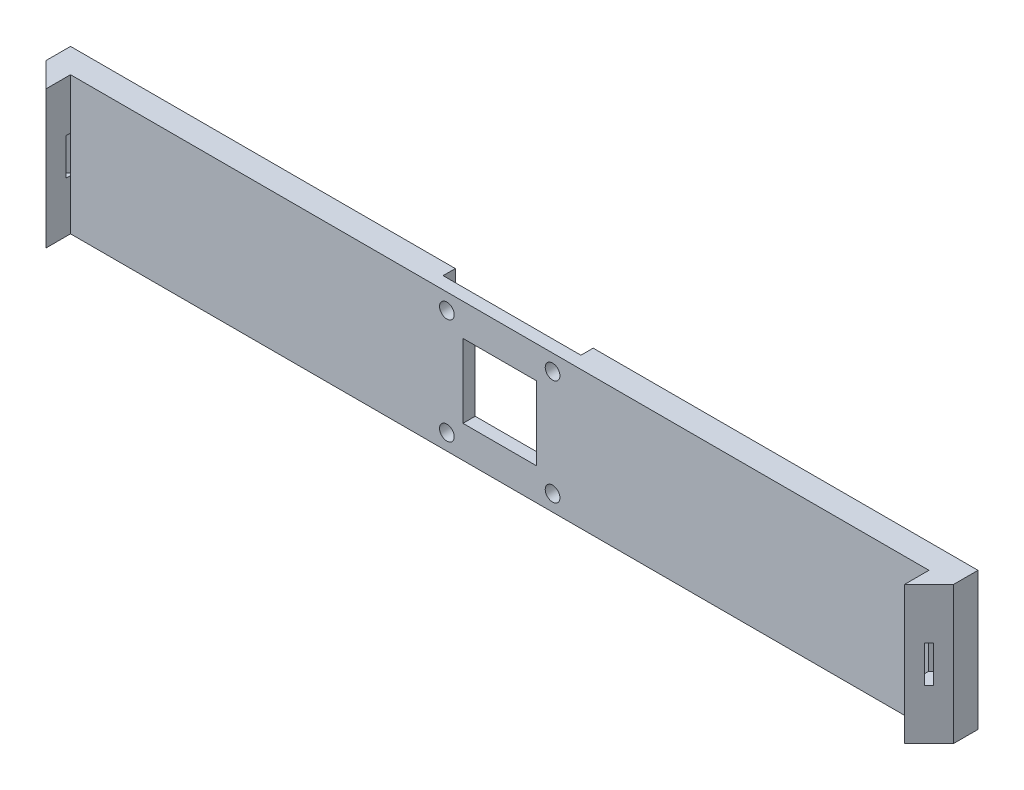
ISO-10303-21;
HEADER;
FILE_DESCRIPTION(('STEP AP214'),'2;1');
FILE_NAME('part.step','',(''),(''),'','','');
FILE_SCHEMA(('AUTOMOTIVE_DESIGN { 1 0 10303 214 1 1 1 1 }'));
ENDSEC;
DATA;
#1=APPLICATION_CONTEXT('core data for automotive mechanical design processes');
#2=APPLICATION_PROTOCOL_DEFINITION('international standard','automotive_design',2000,#1);
#3=PRODUCT_CONTEXT('',#1,'mechanical');
#4=PRODUCT('Part','Part','',(#3));
#5=PRODUCT_RELATED_PRODUCT_CATEGORY('part','',(#4));
#6=PRODUCT_DEFINITION_FORMATION('','',#4);
#7=PRODUCT_DEFINITION_CONTEXT('part definition',#1,'design');
#8=PRODUCT_DEFINITION('design','',#6,#7);
#9=PRODUCT_DEFINITION_SHAPE('','',#8);
#10=(LENGTH_UNIT() NAMED_UNIT(*) SI_UNIT(.MILLI.,.METRE.));
#11=(NAMED_UNIT(*) PLANE_ANGLE_UNIT() SI_UNIT($,.RADIAN.));
#12=(NAMED_UNIT(*) SI_UNIT($,.STERADIAN.) SOLID_ANGLE_UNIT());
#13=UNCERTAINTY_MEASURE_WITH_UNIT(LENGTH_MEASURE(1.E-05),#10,'distance_accuracy_value','');
#14=(GEOMETRIC_REPRESENTATION_CONTEXT(3) GLOBAL_UNCERTAINTY_ASSIGNED_CONTEXT((#13)) GLOBAL_UNIT_ASSIGNED_CONTEXT((#10,
#11,#12)) REPRESENTATION_CONTEXT('',''));
#15=CARTESIAN_POINT('',(0.,0.,0.));
#16=DIRECTION('',(0.,0.,1.));
#17=DIRECTION('',(1.,0.,0.));
#18=AXIS2_PLACEMENT_3D('',#15,#16,#17);
#19=CARTESIAN_POINT('',(0.,0.,0.));
#20=DIRECTION('',(0.,0.,-1.));
#21=DIRECTION('',(-1.,0.,0.));
#22=AXIS2_PLACEMENT_3D('',#19,#20,#21);
#23=PLANE('',#22);
#24=DIRECTION('',(0.,1.,0.));
#25=VECTOR('',#24,1.);
#26=CARTESIAN_POINT('',(-28.0999999999999,-28.1,0.));
#27=LINE('',#26,#25);
#28=CARTESIAN_POINT('',(-28.0999999999999,-28.1,0.));
#29=VERTEX_POINT('',#28);
#30=CARTESIAN_POINT('',(-28.0999999999999,28.1,0.));
#31=VERTEX_POINT('',#30);
#32=EDGE_CURVE('E214',#29,#31,#27,.T.);
#33=ORIENTED_EDGE('',*,*,#32,.F.);
#34=DIRECTION('',(1.,0.,0.));
#35=VECTOR('',#34,1.);
#36=CARTESIAN_POINT('',(-175.,-28.1,0.));
#37=LINE('',#36,#35);
#38=CARTESIAN_POINT('',(-185.,-28.1,0.));
#39=VERTEX_POINT('',#38);
#40=EDGE_CURVE('E424',#39,#29,#37,.T.);
#41=ORIENTED_EDGE('',*,*,#40,.F.);
#42=DIRECTION('',(0.,-1.,0.));
#43=VECTOR('',#42,1.);
#44=CARTESIAN_POINT('',(-185.,-28.1,0.));
#45=LINE('',#44,#43);
#46=CARTESIAN_POINT('',(-185.,28.1,0.));
#47=VERTEX_POINT('',#46);
#48=EDGE_CURVE('E384',#47,#39,#45,.T.);
#49=ORIENTED_EDGE('',*,*,#48,.F.);
#50=DIRECTION('',(-1.,0.,0.));
#51=VECTOR('',#50,1.);
#52=CARTESIAN_POINT('',(-175.,28.1,0.));
#53=LINE('',#52,#51);
#54=EDGE_CURVE('E419',#31,#47,#53,.T.);
#55=ORIENTED_EDGE('',*,*,#54,.F.);
#56=EDGE_LOOP('',(#33,#41,#49,#55));
#57=FACE_BOUND('',#56,.T.);
#58=ADVANCED_FACE('F36',(#57),#23,.T.);
#59=CARTESIAN_POINT('',(0.,0.,10.));
#60=DIRECTION('',(0.,0.,-1.));
#61=DIRECTION('',(-1.,0.,0.));
#62=AXIS2_PLACEMENT_3D('',#59,#60,#61);
#63=PLANE('',#62);
#64=DIRECTION('',(0.,-1.,0.));
#65=VECTOR('',#64,1.);
#66=CARTESIAN_POINT('',(175.,28.1,10.));
#67=LINE('',#66,#65);
#68=CARTESIAN_POINT('',(175.,28.1,10.));
#69=VERTEX_POINT('',#68);
#70=CARTESIAN_POINT('',(175.,-28.1,10.));
#71=VERTEX_POINT('',#70);
#72=EDGE_CURVE('E400',#69,#71,#67,.T.);
#73=ORIENTED_EDGE('',*,*,#72,.F.);
#74=DIRECTION('',(-1.,0.,0.));
#75=VECTOR('',#74,1.);
#76=CARTESIAN_POINT('',(-175.,28.1,10.));
#77=LINE('',#76,#75);
#78=CARTESIAN_POINT('',(-175.,28.1,10.));
#79=VERTEX_POINT('',#78);
#80=EDGE_CURVE('E420',#69,#79,#77,.T.);
#81=ORIENTED_EDGE('',*,*,#80,.T.);
#82=DIRECTION('',(0.,1.,0.));
#83=VECTOR('',#82,1.);
#84=CARTESIAN_POINT('',(-175.,-28.1,10.));
#85=LINE('',#84,#83);
#86=CARTESIAN_POINT('',(-175.,-28.1,10.));
#87=VERTEX_POINT('',#86);
#88=EDGE_CURVE('E374',#87,#79,#85,.T.);
#89=ORIENTED_EDGE('',*,*,#88,.F.);
#90=DIRECTION('',(1.,0.,0.));
#91=VECTOR('',#90,1.);
#92=CARTESIAN_POINT('',(-175.,-28.1,10.));
#93=LINE('',#92,#91);
#94=EDGE_CURVE('E423',#87,#71,#93,.T.);
#95=ORIENTED_EDGE('',*,*,#94,.T.);
#96=EDGE_LOOP('',(#73,#81,#89,#95));
#97=FACE_BOUND('',#96,.T.);
#98=CARTESIAN_POINT('',(-21.55,-21.55,10.));
#99=DIRECTION('',(0.,0.,1.));
#100=DIRECTION('',(1.,0.,0.));
#101=AXIS2_PLACEMENT_3D('',#98,#99,#100);
#102=CIRCLE('',#101,3.);
#103=CARTESIAN_POINT('',(-18.55,-21.55,10.));
#104=VERTEX_POINT('',#103);
#105=EDGE_CURVE('E274',#104,#104,#102,.T.);
#106=ORIENTED_EDGE('',*,*,#105,.F.);
#107=EDGE_LOOP('',(#106));
#108=FACE_BOUND('',#107,.T.);
#109=CARTESIAN_POINT('',(21.55,-21.55,10.));
#110=DIRECTION('',(0.,0.,1.));
#111=DIRECTION('',(1.,0.,0.));
#112=AXIS2_PLACEMENT_3D('',#109,#110,#111);
#113=CIRCLE('',#112,3.);
#114=CARTESIAN_POINT('',(24.55,-21.55,10.));
#115=VERTEX_POINT('',#114);
#116=EDGE_CURVE('E277',#115,#115,#113,.T.);
#117=ORIENTED_EDGE('',*,*,#116,.F.);
#118=EDGE_LOOP('',(#117));
#119=FACE_BOUND('',#118,.T.);
#120=CARTESIAN_POINT('',(21.55,21.55,10.));
#121=DIRECTION('',(0.,0.,1.));
#122=DIRECTION('',(1.,0.,0.));
#123=AXIS2_PLACEMENT_3D('',#120,#121,#122);
#124=CIRCLE('',#123,3.);
#125=CARTESIAN_POINT('',(24.55,21.55,10.));
#126=VERTEX_POINT('',#125);
#127=EDGE_CURVE('E280',#126,#126,#124,.T.);
#128=ORIENTED_EDGE('',*,*,#127,.F.);
#129=EDGE_LOOP('',(#128));
#130=FACE_BOUND('',#129,.T.);
#131=CARTESIAN_POINT('',(-21.55,21.55,10.));
#132=DIRECTION('',(0.,0.,1.));
#133=DIRECTION('',(1.,0.,0.));
#134=AXIS2_PLACEMENT_3D('',#131,#132,#133);
#135=CIRCLE('',#134,3.);
#136=CARTESIAN_POINT('',(-18.55,21.55,10.));
#137=VERTEX_POINT('',#136);
#138=EDGE_CURVE('E283',#137,#137,#135,.T.);
#139=ORIENTED_EDGE('',*,*,#138,.F.);
#140=EDGE_LOOP('',(#139));
#141=FACE_BOUND('',#140,.T.);
#142=DIRECTION('',(0.,-1.,0.));
#143=VECTOR('',#142,1.);
#144=CARTESIAN_POINT('',(-15.,15.,10.));
#145=LINE('',#144,#143);
#146=CARTESIAN_POINT('',(-15.,15.,10.));
#147=VERTEX_POINT('',#146);
#148=CARTESIAN_POINT('',(-15.,-15.,10.));
#149=VERTEX_POINT('',#148);
#150=EDGE_CURVE('E262',#147,#149,#145,.T.);
#151=ORIENTED_EDGE('',*,*,#150,.F.);
#152=DIRECTION('',(-1.,0.,0.));
#153=VECTOR('',#152,1.);
#154=CARTESIAN_POINT('',(-15.,15.,10.));
#155=LINE('',#154,#153);
#156=CARTESIAN_POINT('',(15.,15.,10.));
#157=VERTEX_POINT('',#156);
#158=EDGE_CURVE('E271',#157,#147,#155,.T.);
#159=ORIENTED_EDGE('',*,*,#158,.F.);
#160=DIRECTION('',(0.,1.,0.));
#161=VECTOR('',#160,1.);
#162=CARTESIAN_POINT('',(15.,15.,10.));
#163=LINE('',#162,#161);
#164=CARTESIAN_POINT('',(15.,-15.,10.));
#165=VERTEX_POINT('',#164);
#166=EDGE_CURVE('E268',#165,#157,#163,.T.);
#167=ORIENTED_EDGE('',*,*,#166,.F.);
#168=DIRECTION('',(1.,0.,0.));
#169=VECTOR('',#168,1.);
#170=CARTESIAN_POINT('',(-15.,-15.,10.));
#171=LINE('',#170,#169);
#172=EDGE_CURVE('E265',#149,#165,#171,.T.);
#173=ORIENTED_EDGE('',*,*,#172,.F.);
#174=EDGE_LOOP('',(#151,#159,#167,#173));
#175=FACE_BOUND('',#174,.T.);
#176=ADVANCED_FACE('F473',(#97,#108,#119,#130,#141,#175),#63,.F.);
#177=CARTESIAN_POINT('',(-175.,28.1,10.));
#178=DIRECTION('',(0.,-1.,0.));
#179=DIRECTION('',(0.,0.,-1.));
#180=AXIS2_PLACEMENT_3D('',#177,#178,#179);
#181=PLANE('',#180);
#182=DIRECTION('',(1.,0.,0.));
#183=VECTOR('',#182,1.);
#184=CARTESIAN_POINT('',(28.0999999999999,28.1,5.));
#185=LINE('',#184,#183);
#186=CARTESIAN_POINT('',(-28.0999999999999,28.1,5.));
#187=VERTEX_POINT('',#186);
#188=CARTESIAN_POINT('',(28.0999999999999,28.1,5.));
#189=VERTEX_POINT('',#188);
#190=EDGE_CURVE('E225',#187,#189,#185,.T.);
#191=ORIENTED_EDGE('',*,*,#190,.F.);
#192=DIRECTION('',(0.,0.,-1.));
#193=VECTOR('',#192,1.);
#194=CARTESIAN_POINT('',(-28.0999999999999,28.1,5.));
#195=LINE('',#194,#193);
#196=EDGE_CURVE('E208',#187,#31,#195,.T.);
#197=ORIENTED_EDGE('',*,*,#196,.T.);
#198=ORIENTED_EDGE('',*,*,#54,.T.);
#199=DIRECTION('',(0.,0.,-1.));
#200=VECTOR('',#199,1.);
#201=CARTESIAN_POINT('',(-185.,28.1,0.));
#202=LINE('',#201,#200);
#203=CARTESIAN_POINT('',(-185.,28.1,10.));
#204=VERTEX_POINT('',#203);
#205=EDGE_CURVE('E390',#204,#47,#202,.T.);
#206=ORIENTED_EDGE('',*,*,#205,.F.);
#207=DIRECTION('',(-0.707106781186548,0.,-0.707106781186547));
#208=VECTOR('',#207,1.);
#209=CARTESIAN_POINT('',(-175.,28.1,20.));
#210=LINE('',#209,#208);
#211=CARTESIAN_POINT('',(-175.,28.1,20.));
#212=VERTEX_POINT('',#211);
#213=EDGE_CURVE('E361',#212,#204,#210,.T.);
#214=ORIENTED_EDGE('',*,*,#213,.F.);
#215=DIRECTION('',(0.,0.,-1.));
#216=VECTOR('',#215,1.);
#217=CARTESIAN_POINT('',(-175.,28.1,20.));
#218=LINE('',#217,#216);
#219=EDGE_CURVE('E377',#212,#79,#218,.T.);
#220=ORIENTED_EDGE('',*,*,#219,.T.);
#221=ORIENTED_EDGE('',*,*,#80,.F.);
#222=DIRECTION('',(0.,0.,-1.));
#223=VECTOR('',#222,1.);
#224=CARTESIAN_POINT('',(175.,28.1,20.));
#225=LINE('',#224,#223);
#226=CARTESIAN_POINT('',(175.,28.1,20.));
#227=VERTEX_POINT('',#226);
#228=EDGE_CURVE('E407',#227,#69,#225,.T.);
#229=ORIENTED_EDGE('',*,*,#228,.F.);
#230=DIRECTION('',(-0.707106781186548,0.,0.707106781186547));
#231=VECTOR('',#230,1.);
#232=CARTESIAN_POINT('',(175.,28.1,20.));
#233=LINE('',#232,#231);
#234=CARTESIAN_POINT('',(185.,28.1,10.));
#235=VERTEX_POINT('',#234);
#236=EDGE_CURVE('E393',#235,#227,#233,.T.);
#237=ORIENTED_EDGE('',*,*,#236,.F.);
#238=DIRECTION('',(0.,0.,1.));
#239=VECTOR('',#238,1.);
#240=CARTESIAN_POINT('',(185.,28.1,10.));
#241=LINE('',#240,#239);
#242=CARTESIAN_POINT('',(185.,28.1,0.));
#243=VERTEX_POINT('',#242);
#244=EDGE_CURVE('E416',#243,#235,#241,.T.);
#245=ORIENTED_EDGE('',*,*,#244,.F.);
#246=CARTESIAN_POINT('',(28.0999999999999,28.1,0.));
#247=VERTEX_POINT('',#246);
#248=EDGE_CURVE('E427',#243,#247,#53,.T.);
#249=ORIENTED_EDGE('',*,*,#248,.T.);
#250=DIRECTION('',(0.,0.,-1.));
#251=VECTOR('',#250,1.);
#252=CARTESIAN_POINT('',(28.0999999999999,28.1,5.));
#253=LINE('',#252,#251);
#254=EDGE_CURVE('E52',#189,#247,#253,.T.);
#255=ORIENTED_EDGE('',*,*,#254,.F.);
#256=EDGE_LOOP('',(#191,#197,#198,#206,#214,#220,#221,#229,#237,#245,#249,#255));
#257=FACE_BOUND('',#256,.T.);
#258=ADVANCED_FACE('F38',(#257),#181,.F.);
#259=CARTESIAN_POINT('',(-175.,-28.1,10.));
#260=DIRECTION('',(0.,1.,0.));
#261=DIRECTION('',(0.,0.,1.));
#262=AXIS2_PLACEMENT_3D('',#259,#260,#261);
#263=PLANE('',#262);
#264=ORIENTED_EDGE('',*,*,#40,.T.);
#265=DIRECTION('',(0.,0.,-1.));
#266=VECTOR('',#265,1.);
#267=CARTESIAN_POINT('',(-28.0999999999999,-28.1,5.));
#268=LINE('',#267,#266);
#269=CARTESIAN_POINT('',(-28.0999999999999,-28.1,5.));
#270=VERTEX_POINT('',#269);
#271=EDGE_CURVE('E238',#270,#29,#268,.T.);
#272=ORIENTED_EDGE('',*,*,#271,.F.);
#273=DIRECTION('',(-1.,0.,0.));
#274=VECTOR('',#273,1.);
#275=CARTESIAN_POINT('',(28.0999999999999,-28.1,5.));
#276=LINE('',#275,#274);
#277=CARTESIAN_POINT('',(28.0999999999999,-28.1,5.));
#278=VERTEX_POINT('',#277);
#279=EDGE_CURVE('E218',#278,#270,#276,.T.);
#280=ORIENTED_EDGE('',*,*,#279,.F.);
#281=DIRECTION('',(0.,0.,-1.));
#282=VECTOR('',#281,1.);
#283=CARTESIAN_POINT('',(28.0999999999999,-28.1,5.));
#284=LINE('',#283,#282);
#285=CARTESIAN_POINT('',(28.0999999999999,-28.1,0.));
#286=VERTEX_POINT('',#285);
#287=EDGE_CURVE('E240',#278,#286,#284,.T.);
#288=ORIENTED_EDGE('',*,*,#287,.T.);
#289=CARTESIAN_POINT('',(185.,-28.1,0.));
#290=VERTEX_POINT('',#289);
#291=EDGE_CURVE('E429',#286,#290,#37,.T.);
#292=ORIENTED_EDGE('',*,*,#291,.T.);
#293=DIRECTION('',(0.,0.,-1.));
#294=VECTOR('',#293,1.);
#295=CARTESIAN_POINT('',(185.,-28.1,10.));
#296=LINE('',#295,#294);
#297=CARTESIAN_POINT('',(185.,-28.1,10.));
#298=VERTEX_POINT('',#297);
#299=EDGE_CURVE('E410',#298,#290,#296,.T.);
#300=ORIENTED_EDGE('',*,*,#299,.F.);
#301=DIRECTION('',(-0.707106781186548,0.,0.707106781186547));
#302=VECTOR('',#301,1.);
#303=CARTESIAN_POINT('',(175.,-28.1,20.));
#304=LINE('',#303,#302);
#305=CARTESIAN_POINT('',(175.,-28.1,20.));
#306=VERTEX_POINT('',#305);
#307=EDGE_CURVE('E394',#298,#306,#304,.T.);
#308=ORIENTED_EDGE('',*,*,#307,.T.);
#309=DIRECTION('',(0.,0.,-1.));
#310=VECTOR('',#309,1.);
#311=CARTESIAN_POINT('',(175.,-28.1,20.));
#312=LINE('',#311,#310);
#313=EDGE_CURVE('E403',#306,#71,#312,.T.);
#314=ORIENTED_EDGE('',*,*,#313,.T.);
#315=ORIENTED_EDGE('',*,*,#94,.F.);
#316=DIRECTION('',(0.,0.,-1.));
#317=VECTOR('',#316,1.);
#318=CARTESIAN_POINT('',(-175.,-28.1,20.));
#319=LINE('',#318,#317);
#320=CARTESIAN_POINT('',(-175.,-28.1,20.));
#321=VERTEX_POINT('',#320);
#322=EDGE_CURVE('E381',#321,#87,#319,.T.);
#323=ORIENTED_EDGE('',*,*,#322,.F.);
#324=DIRECTION('',(-0.707106781186548,0.,-0.707106781186547));
#325=VECTOR('',#324,1.);
#326=CARTESIAN_POINT('',(-175.,-28.1,20.));
#327=LINE('',#326,#325);
#328=CARTESIAN_POINT('',(-185.,-28.1,10.));
#329=VERTEX_POINT('',#328);
#330=EDGE_CURVE('E367',#321,#329,#327,.T.);
#331=ORIENTED_EDGE('',*,*,#330,.T.);
#332=DIRECTION('',(0.,0.,1.));
#333=VECTOR('',#332,1.);
#334=CARTESIAN_POINT('',(-185.,-28.1,0.));
#335=LINE('',#334,#333);
#336=EDGE_CURVE('E387',#39,#329,#335,.T.);
#337=ORIENTED_EDGE('',*,*,#336,.F.);
#338=EDGE_LOOP('',(#264,#272,#280,#288,#292,#300,#308,#314,#315,#323,#331,#337));
#339=FACE_BOUND('',#338,.T.);
#340=ADVANCED_FACE('F484',(#339),#263,.F.);
#341=DIRECTION('',(0.,-1.,0.));
#342=VECTOR('',#341,1.);
#343=CARTESIAN_POINT('',(28.0999999999999,-28.1,0.));
#344=LINE('',#343,#342);
#345=EDGE_CURVE('E228',#247,#286,#344,.T.);
#346=ORIENTED_EDGE('',*,*,#345,.F.);
#347=ORIENTED_EDGE('',*,*,#248,.F.);
#348=DIRECTION('',(0.,1.,0.));
#349=VECTOR('',#348,1.);
#350=CARTESIAN_POINT('',(185.,28.1,0.));
#351=LINE('',#350,#349);
#352=EDGE_CURVE('E413',#290,#243,#351,.T.);
#353=ORIENTED_EDGE('',*,*,#352,.F.);
#354=ORIENTED_EDGE('',*,*,#291,.F.);
#355=EDGE_LOOP('',(#346,#347,#353,#354));
#356=FACE_BOUND('',#355,.T.);
#357=ADVANCED_FACE('F476',(#356),#23,.T.);
#358=CARTESIAN_POINT('',(185.,0.,0.));
#359=DIRECTION('',(1.,0.,0.));
#360=DIRECTION('',(0.,0.,-1.));
#361=AXIS2_PLACEMENT_3D('',#358,#359,#360);
#362=PLANE('',#361);
#363=DIRECTION('',(0.,1.,0.));
#364=VECTOR('',#363,1.);
#365=CARTESIAN_POINT('',(185.,-28.1,10.));
#366=LINE('',#365,#364);
#367=EDGE_CURVE('E397',#298,#235,#366,.T.);
#368=ORIENTED_EDGE('',*,*,#367,.F.);
#369=ORIENTED_EDGE('',*,*,#299,.T.);
#370=ORIENTED_EDGE('',*,*,#352,.T.);
#371=ORIENTED_EDGE('',*,*,#244,.T.);
#372=EDGE_LOOP('',(#368,#369,#370,#371));
#373=FACE_BOUND('',#372,.T.);
#374=ADVANCED_FACE('F483',(#373),#362,.T.);
#375=CARTESIAN_POINT('',(175.,28.1,20.));
#376=DIRECTION('',(1.,0.,0.));
#377=DIRECTION('',(0.,0.,-1.));
#378=AXIS2_PLACEMENT_3D('',#375,#376,#377);
#379=PLANE('',#378);
#380=DIRECTION('',(0.,0.,1.));
#381=VECTOR('',#380,1.);
#382=CARTESIAN_POINT('',(175.,7.5,20.));
#383=LINE('',#382,#381);
#384=CARTESIAN_POINT('',(175.,7.5,10.1005050633884));
#385=VERTEX_POINT('',#384);
#386=CARTESIAN_POINT('',(175.,7.5,11.7677669529664));
#387=VERTEX_POINT('',#386);
#388=EDGE_CURVE('E352',#385,#387,#383,.T.);
#389=ORIENTED_EDGE('',*,*,#388,.T.);
#390=DIRECTION('',(0.,-1.,0.));
#391=VECTOR('',#390,1.);
#392=CARTESIAN_POINT('',(175.,28.1,11.7677669529664));
#393=LINE('',#392,#391);
#394=CARTESIAN_POINT('',(175.,-7.5,11.7677669529664));
#395=VERTEX_POINT('',#394);
#396=EDGE_CURVE('E355',#387,#395,#393,.T.);
#397=ORIENTED_EDGE('',*,*,#396,.T.);
#398=DIRECTION('',(0.,0.,-1.));
#399=VECTOR('',#398,1.);
#400=CARTESIAN_POINT('',(175.,-7.5,20.));
#401=LINE('',#400,#399);
#402=CARTESIAN_POINT('',(175.,-7.5,10.1005050633884));
#403=VERTEX_POINT('',#402);
#404=EDGE_CURVE('E343',#395,#403,#401,.T.);
#405=ORIENTED_EDGE('',*,*,#404,.T.);
#406=DIRECTION('',(0.,-1.,0.));
#407=VECTOR('',#406,1.);
#408=CARTESIAN_POINT('',(175.,28.1,10.1005050633884));
#409=LINE('',#408,#407);
#410=EDGE_CURVE('E45',#385,#403,#409,.T.);
#411=ORIENTED_EDGE('',*,*,#410,.F.);
#412=EDGE_LOOP('',(#389,#397,#405,#411));
#413=FACE_BOUND('',#412,.T.);
#414=ORIENTED_EDGE('',*,*,#72,.T.);
#415=ORIENTED_EDGE('',*,*,#313,.F.);
#416=DIRECTION('',(0.,-1.,0.));
#417=VECTOR('',#416,1.);
#418=CARTESIAN_POINT('',(175.,28.1,20.));
#419=LINE('',#418,#417);
#420=EDGE_CURVE('E401',#227,#306,#419,.T.);
#421=ORIENTED_EDGE('',*,*,#420,.F.);
#422=ORIENTED_EDGE('',*,*,#228,.T.);
#423=EDGE_LOOP('',(#414,#415,#421,#422));
#424=FACE_BOUND('',#423,.T.);
#425=ADVANCED_FACE('F444',(#413,#424),#379,.F.);
#426=CARTESIAN_POINT('',(175.,-28.1,20.));
#427=DIRECTION('',(-0.707106781186547,0.,-0.707106781186548));
#428=DIRECTION('',(-0.707106781186548,0.,0.707106781186547));
#429=AXIS2_PLACEMENT_3D('',#426,#427,#428);
#430=PLANE('',#429);
#431=DIRECTION('',(0.70710678118655,0.,-0.707106781186545));
#432=VECTOR('',#431,1.);
#433=CARTESIAN_POINT('',(180.883883476483,-7.5,14.1161165235168));
#434=LINE('',#433,#432);
#435=CARTESIAN_POINT('',(179.116116523517,-7.5,15.8838834764832));
#436=VERTEX_POINT('',#435);
#437=CARTESIAN_POINT('',(180.883883476483,-7.5,14.1161165235168));
#438=VERTEX_POINT('',#437);
#439=EDGE_CURVE('E333',#436,#438,#434,.T.);
#440=ORIENTED_EDGE('',*,*,#439,.F.);
#441=DIRECTION('',(0.,-1.,0.));
#442=VECTOR('',#441,1.);
#443=CARTESIAN_POINT('',(179.116116523517,-7.5,15.8838834764832));
#444=LINE('',#443,#442);
#445=CARTESIAN_POINT('',(179.116116523517,7.5,15.8838834764832));
#446=VERTEX_POINT('',#445);
#447=EDGE_CURVE('E322',#446,#436,#444,.T.);
#448=ORIENTED_EDGE('',*,*,#447,.F.);
#449=DIRECTION('',(-0.70710678118655,0.,0.707106781186545));
#450=VECTOR('',#449,1.);
#451=CARTESIAN_POINT('',(180.883883476483,7.5,14.1161165235168));
#452=LINE('',#451,#450);
#453=CARTESIAN_POINT('',(180.883883476483,7.5,14.1161165235168));
#454=VERTEX_POINT('',#453);
#455=EDGE_CURVE('E326',#454,#446,#452,.T.);
#456=ORIENTED_EDGE('',*,*,#455,.F.);
#457=DIRECTION('',(0.,1.,0.));
#458=VECTOR('',#457,1.);
#459=CARTESIAN_POINT('',(180.883883476483,-7.5,14.1161165235168));
#460=LINE('',#459,#458);
#461=EDGE_CURVE('E336',#438,#454,#460,.T.);
#462=ORIENTED_EDGE('',*,*,#461,.F.);
#463=EDGE_LOOP('',(#440,#448,#456,#462));
#464=FACE_BOUND('',#463,.T.);
#465=ORIENTED_EDGE('',*,*,#236,.T.);
#466=ORIENTED_EDGE('',*,*,#420,.T.);
#467=ORIENTED_EDGE('',*,*,#307,.F.);
#468=ORIENTED_EDGE('',*,*,#367,.T.);
#469=EDGE_LOOP('',(#465,#466,#467,#468));
#470=FACE_BOUND('',#469,.T.);
#471=ADVANCED_FACE('F456',(#464,#470),#430,.F.);
#472=CARTESIAN_POINT('',(-185.,0.,0.));
#473=DIRECTION('',(1.,0.,0.));
#474=DIRECTION('',(0.,0.,-1.));
#475=AXIS2_PLACEMENT_3D('',#472,#473,#474);
#476=PLANE('',#475);
#477=ORIENTED_EDGE('',*,*,#336,.T.);
#478=DIRECTION('',(0.,1.,0.));
#479=VECTOR('',#478,1.);
#480=CARTESIAN_POINT('',(-185.,-28.1,10.));
#481=LINE('',#480,#479);
#482=EDGE_CURVE('E370',#329,#204,#481,.T.);
#483=ORIENTED_EDGE('',*,*,#482,.T.);
#484=ORIENTED_EDGE('',*,*,#205,.T.);
#485=ORIENTED_EDGE('',*,*,#48,.T.);
#486=EDGE_LOOP('',(#477,#483,#484,#485));
#487=FACE_BOUND('',#486,.T.);
#488=ADVANCED_FACE('F573',(#487),#476,.F.);
#489=CARTESIAN_POINT('',(-175.,-28.1,20.));
#490=DIRECTION('',(-1.,0.,0.));
#491=DIRECTION('',(0.,0.,1.));
#492=AXIS2_PLACEMENT_3D('',#489,#490,#491);
#493=PLANE('',#492);
#494=DIRECTION('',(0.,0.,1.));
#495=VECTOR('',#494,1.);
#496=CARTESIAN_POINT('',(-175.,-7.5,20.));
#497=LINE('',#496,#495);
#498=CARTESIAN_POINT('',(-175.,-7.5,10.1005050633884));
#499=VERTEX_POINT('',#498);
#500=CARTESIAN_POINT('',(-175.,-7.5,11.7677669529664));
#501=VERTEX_POINT('',#500);
#502=EDGE_CURVE('E316',#499,#501,#497,.T.);
#503=ORIENTED_EDGE('',*,*,#502,.T.);
#504=DIRECTION('',(0.,1.,0.));
#505=VECTOR('',#504,1.);
#506=CARTESIAN_POINT('',(-175.,-28.1,11.7677669529664));
#507=LINE('',#506,#505);
#508=CARTESIAN_POINT('',(-175.,7.5,11.7677669529664));
#509=VERTEX_POINT('',#508);
#510=EDGE_CURVE('E319',#501,#509,#507,.T.);
#511=ORIENTED_EDGE('',*,*,#510,.T.);
#512=DIRECTION('',(0.,0.,-1.));
#513=VECTOR('',#512,1.);
#514=CARTESIAN_POINT('',(-175.,7.5,20.));
#515=LINE('',#514,#513);
#516=CARTESIAN_POINT('',(-175.,7.5,10.1005050633884));
#517=VERTEX_POINT('',#516);
#518=EDGE_CURVE('E307',#509,#517,#515,.T.);
#519=ORIENTED_EDGE('',*,*,#518,.T.);
#520=DIRECTION('',(0.,1.,0.));
#521=VECTOR('',#520,1.);
#522=CARTESIAN_POINT('',(-175.,-28.1,10.1005050633884));
#523=LINE('',#522,#521);
#524=EDGE_CURVE('E11',#499,#517,#523,.T.);
#525=ORIENTED_EDGE('',*,*,#524,.F.);
#526=EDGE_LOOP('',(#503,#511,#519,#525));
#527=FACE_BOUND('',#526,.T.);
#528=ORIENTED_EDGE('',*,*,#88,.T.);
#529=ORIENTED_EDGE('',*,*,#219,.F.);
#530=DIRECTION('',(0.,1.,0.));
#531=VECTOR('',#530,1.);
#532=CARTESIAN_POINT('',(-175.,-28.1,20.));
#533=LINE('',#532,#531);
#534=EDGE_CURVE('E375',#321,#212,#533,.T.);
#535=ORIENTED_EDGE('',*,*,#534,.F.);
#536=ORIENTED_EDGE('',*,*,#322,.T.);
#537=EDGE_LOOP('',(#528,#529,#535,#536));
#538=FACE_BOUND('',#537,.T.);
#539=ADVANCED_FACE('F569',(#527,#538),#493,.F.);
#540=CARTESIAN_POINT('',(-175.,-28.1,20.));
#541=DIRECTION('',(0.707106781186547,0.,-0.707106781186548));
#542=DIRECTION('',(-0.707106781186548,0.,-0.707106781186547));
#543=AXIS2_PLACEMENT_3D('',#540,#541,#542);
#544=PLANE('',#543);
#545=DIRECTION('',(-0.70710678118655,0.,-0.707106781186545));
#546=VECTOR('',#545,1.);
#547=CARTESIAN_POINT('',(-180.883883476483,7.5,14.1161165235168));
#548=LINE('',#547,#546);
#549=CARTESIAN_POINT('',(-179.116116523517,7.5,15.8838834764832));
#550=VERTEX_POINT('',#549);
#551=CARTESIAN_POINT('',(-180.883883476483,7.5,14.1161165235168));
#552=VERTEX_POINT('',#551);
#553=EDGE_CURVE('E297',#550,#552,#548,.T.);
#554=ORIENTED_EDGE('',*,*,#553,.F.);
#555=DIRECTION('',(0.,1.,0.));
#556=VECTOR('',#555,1.);
#557=CARTESIAN_POINT('',(-179.116116523517,7.5,15.8838834764832));
#558=LINE('',#557,#556);
#559=CARTESIAN_POINT('',(-179.116116523517,-7.5,15.8838834764832));
#560=VERTEX_POINT('',#559);
#561=EDGE_CURVE('E286',#560,#550,#558,.T.);
#562=ORIENTED_EDGE('',*,*,#561,.F.);
#563=DIRECTION('',(0.70710678118655,0.,0.707106781186545));
#564=VECTOR('',#563,1.);
#565=CARTESIAN_POINT('',(-180.883883476483,-7.5,14.1161165235168));
#566=LINE('',#565,#564);
#567=CARTESIAN_POINT('',(-180.883883476483,-7.5,14.1161165235168));
#568=VERTEX_POINT('',#567);
#569=EDGE_CURVE('E290',#568,#560,#566,.T.);
#570=ORIENTED_EDGE('',*,*,#569,.F.);
#571=DIRECTION('',(0.,-1.,0.));
#572=VECTOR('',#571,1.);
#573=CARTESIAN_POINT('',(-180.883883476483,7.5,14.1161165235168));
#574=LINE('',#573,#572);
#575=EDGE_CURVE('E300',#552,#568,#574,.T.);
#576=ORIENTED_EDGE('',*,*,#575,.F.);
#577=EDGE_LOOP('',(#554,#562,#570,#576));
#578=FACE_BOUND('',#577,.T.);
#579=ORIENTED_EDGE('',*,*,#213,.T.);
#580=ORIENTED_EDGE('',*,*,#482,.F.);
#581=ORIENTED_EDGE('',*,*,#330,.F.);
#582=ORIENTED_EDGE('',*,*,#534,.T.);
#583=EDGE_LOOP('',(#579,#580,#581,#582));
#584=FACE_BOUND('',#583,.T.);
#585=ADVANCED_FACE('F565',(#578,#584),#544,.F.);
#586=CARTESIAN_POINT('',(15.,-15.,0.));
#587=DIRECTION('',(1.,0.,0.));
#588=DIRECTION('',(0.,0.,-1.));
#589=AXIS2_PLACEMENT_3D('',#586,#587,#588);
#590=PLANE('',#589);
#591=DIRECTION('',(0.,0.,1.));
#592=VECTOR('',#591,1.);
#593=CARTESIAN_POINT('',(15.,15.,0.));
#594=LINE('',#593,#592);
#595=CARTESIAN_POINT('',(15.,15.,5.));
#596=VERTEX_POINT('',#595);
#597=EDGE_CURVE('E358',#596,#157,#594,.T.);
#598=ORIENTED_EDGE('',*,*,#597,.F.);
#599=DIRECTION('',(0.,-1.,0.));
#600=VECTOR('',#599,1.);
#601=CARTESIAN_POINT('',(15.,-15.,5.));
#602=LINE('',#601,#600);
#603=CARTESIAN_POINT('',(15.,-15.,5.));
#604=VERTEX_POINT('',#603);
#605=EDGE_CURVE('E60',#596,#604,#602,.T.);
#606=ORIENTED_EDGE('',*,*,#605,.T.);
#607=DIRECTION('',(0.,0.,1.));
#608=VECTOR('',#607,1.);
#609=CARTESIAN_POINT('',(15.,-15.,0.));
#610=LINE('',#609,#608);
#611=EDGE_CURVE('E359',#604,#165,#610,.T.);
#612=ORIENTED_EDGE('',*,*,#611,.T.);
#613=ORIENTED_EDGE('',*,*,#166,.T.);
#614=EDGE_LOOP('',(#598,#606,#612,#613));
#615=FACE_BOUND('',#614,.T.);
#616=ADVANCED_FACE('F555',(#615),#590,.F.);
#617=CARTESIAN_POINT('',(-15.,-15.,0.));
#618=DIRECTION('',(0.,-1.,0.));
#619=DIRECTION('',(0.,0.,-1.));
#620=AXIS2_PLACEMENT_3D('',#617,#618,#619);
#621=PLANE('',#620);
#622=ORIENTED_EDGE('',*,*,#611,.F.);
#623=DIRECTION('',(-1.,0.,0.));
#624=VECTOR('',#623,1.);
#625=CARTESIAN_POINT('',(-15.,-15.,5.));
#626=LINE('',#625,#624);
#627=CARTESIAN_POINT('',(-15.,-15.,5.));
#628=VERTEX_POINT('',#627);
#629=EDGE_CURVE('E258',#604,#628,#626,.T.);
#630=ORIENTED_EDGE('',*,*,#629,.T.);
#631=DIRECTION('',(0.,0.,1.));
#632=VECTOR('',#631,1.);
#633=CARTESIAN_POINT('',(-15.,-15.,0.));
#634=LINE('',#633,#632);
#635=EDGE_CURVE('E362',#628,#149,#634,.T.);
#636=ORIENTED_EDGE('',*,*,#635,.T.);
#637=ORIENTED_EDGE('',*,*,#172,.T.);
#638=EDGE_LOOP('',(#622,#630,#636,#637));
#639=FACE_BOUND('',#638,.T.);
#640=ADVANCED_FACE('F551',(#639),#621,.F.);
#641=CARTESIAN_POINT('',(-15.,-15.,0.));
#642=DIRECTION('',(-1.,0.,0.));
#643=DIRECTION('',(0.,0.,1.));
#644=AXIS2_PLACEMENT_3D('',#641,#642,#643);
#645=PLANE('',#644);
#646=ORIENTED_EDGE('',*,*,#635,.F.);
#647=DIRECTION('',(0.,1.,0.));
#648=VECTOR('',#647,1.);
#649=CARTESIAN_POINT('',(-15.,-15.,5.));
#650=LINE('',#649,#648);
#651=CARTESIAN_POINT('',(-15.,15.,5.));
#652=VERTEX_POINT('',#651);
#653=EDGE_CURVE('E255',#628,#652,#650,.T.);
#654=ORIENTED_EDGE('',*,*,#653,.T.);
#655=DIRECTION('',(0.,0.,1.));
#656=VECTOR('',#655,1.);
#657=CARTESIAN_POINT('',(-15.,15.,0.));
#658=LINE('',#657,#656);
#659=EDGE_CURVE('E364',#652,#147,#658,.T.);
#660=ORIENTED_EDGE('',*,*,#659,.T.);
#661=ORIENTED_EDGE('',*,*,#150,.T.);
#662=EDGE_LOOP('',(#646,#654,#660,#661));
#663=FACE_BOUND('',#662,.T.);
#664=ADVANCED_FACE('F554',(#663),#645,.F.);
#665=CARTESIAN_POINT('',(-15.,15.,0.));
#666=DIRECTION('',(0.,1.,0.));
#667=DIRECTION('',(0.,0.,1.));
#668=AXIS2_PLACEMENT_3D('',#665,#666,#667);
#669=PLANE('',#668);
#670=ORIENTED_EDGE('',*,*,#659,.F.);
#671=DIRECTION('',(1.,0.,0.));
#672=VECTOR('',#671,1.);
#673=CARTESIAN_POINT('',(-15.,15.,5.));
#674=LINE('',#673,#672);
#675=EDGE_CURVE('E253',#652,#596,#674,.T.);
#676=ORIENTED_EDGE('',*,*,#675,.T.);
#677=ORIENTED_EDGE('',*,*,#597,.T.);
#678=ORIENTED_EDGE('',*,*,#158,.T.);
#679=EDGE_LOOP('',(#670,#676,#677,#678));
#680=FACE_BOUND('',#679,.T.);
#681=ADVANCED_FACE('F549',(#680),#669,.F.);
#682=CARTESIAN_POINT('',(21.55,21.55,0.));
#683=DIRECTION('',(0.,0.,1.));
#684=DIRECTION('',(1.,0.,0.));
#685=AXIS2_PLACEMENT_3D('',#682,#683,#684);
#686=CYLINDRICAL_SURFACE('',#685,3.);
#687=CARTESIAN_POINT('',(21.55,21.55,5.));
#688=DIRECTION('',(0.,0.,1.));
#689=DIRECTION('',(1.,0.,0.));
#690=AXIS2_PLACEMENT_3D('',#687,#688,#689);
#691=CIRCLE('',#690,3.);
#692=CARTESIAN_POINT('',(24.55,21.55,5.));
#693=VERTEX_POINT('',#692);
#694=EDGE_CURVE('E250',#693,#693,#691,.F.);
#695=ORIENTED_EDGE('',*,*,#694,.T.);
#696=EDGE_LOOP('',(#695));
#697=FACE_BOUND('',#696,.T.);
#698=ORIENTED_EDGE('',*,*,#127,.T.);
#699=EDGE_LOOP('',(#698));
#700=FACE_BOUND('',#699,.T.);
#701=ADVANCED_FACE('F539',(#697,#700),#686,.F.);
#702=CARTESIAN_POINT('',(-21.55,-21.55,0.));
#703=DIRECTION('',(0.,0.,1.));
#704=DIRECTION('',(1.,0.,0.));
#705=AXIS2_PLACEMENT_3D('',#702,#703,#704);
#706=CYLINDRICAL_SURFACE('',#705,3.);
#707=CARTESIAN_POINT('',(-21.55,-21.55,5.));
#708=DIRECTION('',(0.,0.,1.));
#709=DIRECTION('',(1.,0.,0.));
#710=AXIS2_PLACEMENT_3D('',#707,#708,#709);
#711=CIRCLE('',#710,3.);
#712=CARTESIAN_POINT('',(-18.55,-21.55,5.));
#713=VERTEX_POINT('',#712);
#714=EDGE_CURVE('E247',#713,#713,#711,.F.);
#715=ORIENTED_EDGE('',*,*,#714,.T.);
#716=EDGE_LOOP('',(#715));
#717=FACE_BOUND('',#716,.T.);
#718=ORIENTED_EDGE('',*,*,#105,.T.);
#719=EDGE_LOOP('',(#718));
#720=FACE_BOUND('',#719,.T.);
#721=ADVANCED_FACE('F535',(#717,#720),#706,.F.);
#722=CARTESIAN_POINT('',(-21.55,21.55,0.));
#723=DIRECTION('',(0.,0.,1.));
#724=DIRECTION('',(1.,0.,0.));
#725=AXIS2_PLACEMENT_3D('',#722,#723,#724);
#726=CYLINDRICAL_SURFACE('',#725,3.);
#727=CARTESIAN_POINT('',(-21.55,21.55,5.));
#728=DIRECTION('',(0.,0.,1.));
#729=DIRECTION('',(1.,0.,0.));
#730=AXIS2_PLACEMENT_3D('',#727,#728,#729);
#731=CIRCLE('',#730,3.);
#732=CARTESIAN_POINT('',(-18.55,21.55,5.));
#733=VERTEX_POINT('',#732);
#734=EDGE_CURVE('E244',#733,#733,#731,.F.);
#735=ORIENTED_EDGE('',*,*,#734,.T.);
#736=EDGE_LOOP('',(#735));
#737=FACE_BOUND('',#736,.T.);
#738=ORIENTED_EDGE('',*,*,#138,.T.);
#739=EDGE_LOOP('',(#738));
#740=FACE_BOUND('',#739,.T.);
#741=ADVANCED_FACE('F538',(#737,#740),#726,.F.);
#742=CARTESIAN_POINT('',(21.55,-21.55,0.));
#743=DIRECTION('',(0.,0.,1.));
#744=DIRECTION('',(1.,0.,0.));
#745=AXIS2_PLACEMENT_3D('',#742,#743,#744);
#746=CYLINDRICAL_SURFACE('',#745,3.);
#747=CARTESIAN_POINT('',(21.55,-21.55,5.));
#748=DIRECTION('',(0.,0.,1.));
#749=DIRECTION('',(1.,0.,0.));
#750=AXIS2_PLACEMENT_3D('',#747,#748,#749);
#751=CIRCLE('',#750,3.);
#752=CARTESIAN_POINT('',(24.55,-21.55,5.));
#753=VERTEX_POINT('',#752);
#754=EDGE_CURVE('E40',#753,#753,#751,.F.);
#755=ORIENTED_EDGE('',*,*,#754,.T.);
#756=EDGE_LOOP('',(#755));
#757=FACE_BOUND('',#756,.T.);
#758=ORIENTED_EDGE('',*,*,#116,.T.);
#759=EDGE_LOOP('',(#758));
#760=FACE_BOUND('',#759,.T.);
#761=ADVANCED_FACE('F526',(#757,#760),#746,.F.);
#762=CARTESIAN_POINT('',(92.5502525316935,0.,92.5502525316943));
#763=DIRECTION('',(0.707106781186545,0.,0.70710678118655));
#764=DIRECTION('',(0.70710678118655,0.,-0.707106781186545));
#765=AXIS2_PLACEMENT_3D('',#762,#763,#764);
#766=PLANE('',#765);
#767=ORIENTED_EDGE('',*,*,#410,.T.);
#768=DIRECTION('',(0.70710678118655,0.,-0.707106781186545));
#769=VECTOR('',#768,1.);
#770=CARTESIAN_POINT('',(175.934136008177,-7.5,9.166369055211));
#771=LINE('',#770,#769);
#772=CARTESIAN_POINT('',(175.934136008177,-7.5,9.166369055211));
#773=VERTEX_POINT('',#772);
#774=EDGE_CURVE('E323',#403,#773,#771,.T.);
#775=ORIENTED_EDGE('',*,*,#774,.T.);
#776=DIRECTION('',(0.,1.,0.));
#777=VECTOR('',#776,1.);
#778=CARTESIAN_POINT('',(175.934136008177,-7.5,9.166369055211));
#779=LINE('',#778,#777);
#780=CARTESIAN_POINT('',(175.934136008177,7.5,9.166369055211));
#781=VERTEX_POINT('',#780);
#782=EDGE_CURVE('E325',#773,#781,#779,.T.);
#783=ORIENTED_EDGE('',*,*,#782,.T.);
#784=DIRECTION('',(-0.70710678118655,0.,0.707106781186545));
#785=VECTOR('',#784,1.);
#786=CARTESIAN_POINT('',(175.934136008177,7.5,9.166369055211));
#787=LINE('',#786,#785);
#788=EDGE_CURVE('E329',#781,#385,#787,.T.);
#789=ORIENTED_EDGE('',*,*,#788,.T.);
#790=EDGE_LOOP('',(#767,#775,#783,#789));
#791=FACE_BOUND('',#790,.T.);
#792=ADVANCED_FACE('F435',(#791),#766,.T.);
#793=CARTESIAN_POINT('',(174.166369055211,-7.5,10.9341360081774));
#794=DIRECTION('',(-0.707106781186548,0.,0.707106781186547));
#795=DIRECTION('',(0.707106781186547,0.,0.707106781186548));
#796=AXIS2_PLACEMENT_3D('',#793,#794,#795);
#797=PLANE('',#796);
#798=DIRECTION('',(0.707106781186547,0.,0.707106781186548));
#799=VECTOR('',#798,1.);
#800=CARTESIAN_POINT('',(174.166369055211,7.5,10.9341360081774));
#801=LINE('',#800,#799);
#802=EDGE_CURVE('E341',#387,#446,#801,.T.);
#803=ORIENTED_EDGE('',*,*,#802,.T.);
#804=ORIENTED_EDGE('',*,*,#447,.T.);
#805=DIRECTION('',(0.707106781186547,0.,0.707106781186548));
#806=VECTOR('',#805,1.);
#807=CARTESIAN_POINT('',(174.166369055211,-7.5,10.9341360081774));
#808=LINE('',#807,#806);
#809=EDGE_CURVE('E331',#395,#436,#808,.T.);
#810=ORIENTED_EDGE('',*,*,#809,.F.);
#811=ORIENTED_EDGE('',*,*,#396,.F.);
#812=EDGE_LOOP('',(#803,#804,#810,#811));
#813=FACE_BOUND('',#812,.T.);
#814=ADVANCED_FACE('F448',(#813),#797,.F.);
#815=CARTESIAN_POINT('',(175.934136008177,7.5,9.166369055211));
#816=DIRECTION('',(0.,1.,0.));
#817=DIRECTION('',(0.,0.,1.));
#818=AXIS2_PLACEMENT_3D('',#815,#816,#817);
#819=PLANE('',#818);
#820=ORIENTED_EDGE('',*,*,#788,.F.);
#821=DIRECTION('',(0.707106781186547,0.,0.707106781186548));
#822=VECTOR('',#821,1.);
#823=CARTESIAN_POINT('',(175.934136008177,7.5,9.166369055211));
#824=LINE('',#823,#822);
#825=EDGE_CURVE('E344',#781,#454,#824,.T.);
#826=ORIENTED_EDGE('',*,*,#825,.T.);
#827=ORIENTED_EDGE('',*,*,#455,.T.);
#828=ORIENTED_EDGE('',*,*,#802,.F.);
#829=ORIENTED_EDGE('',*,*,#388,.F.);
#830=EDGE_LOOP('',(#820,#826,#827,#828,#829));
#831=FACE_BOUND('',#830,.T.);
#832=ADVANCED_FACE('F450',(#831),#819,.F.);
#833=CARTESIAN_POINT('',(175.934136008177,-7.5,9.166369055211));
#834=DIRECTION('',(0.,-1.,0.));
#835=DIRECTION('',(0.,0.,-1.));
#836=AXIS2_PLACEMENT_3D('',#833,#834,#835);
#837=PLANE('',#836);
#838=ORIENTED_EDGE('',*,*,#809,.T.);
#839=ORIENTED_EDGE('',*,*,#439,.T.);
#840=DIRECTION('',(0.707106781186547,0.,0.707106781186548));
#841=VECTOR('',#840,1.);
#842=CARTESIAN_POINT('',(175.934136008177,-7.5,9.166369055211));
#843=LINE('',#842,#841);
#844=EDGE_CURVE('E346',#773,#438,#843,.T.);
#845=ORIENTED_EDGE('',*,*,#844,.F.);
#846=ORIENTED_EDGE('',*,*,#774,.F.);
#847=ORIENTED_EDGE('',*,*,#404,.F.);
#848=EDGE_LOOP('',(#838,#839,#845,#846,#847));
#849=FACE_BOUND('',#848,.T.);
#850=ADVANCED_FACE('F441',(#849),#837,.F.);
#851=CARTESIAN_POINT('',(175.934136008177,-7.5,9.166369055211));
#852=DIRECTION('',(0.707106781186548,0.,-0.707106781186547));
#853=DIRECTION('',(-0.707106781186547,0.,-0.707106781186548));
#854=AXIS2_PLACEMENT_3D('',#851,#852,#853);
#855=PLANE('',#854);
#856=ORIENTED_EDGE('',*,*,#461,.T.);
#857=ORIENTED_EDGE('',*,*,#825,.F.);
#858=ORIENTED_EDGE('',*,*,#782,.F.);
#859=ORIENTED_EDGE('',*,*,#844,.T.);
#860=EDGE_LOOP('',(#856,#857,#858,#859));
#861=FACE_BOUND('',#860,.T.);
#862=ADVANCED_FACE('F459',(#861),#855,.F.);
#863=CARTESIAN_POINT('',(-92.5502525316935,0.,92.5502525316942));
#864=DIRECTION('',(-0.707106781186545,0.,0.70710678118655));
#865=DIRECTION('',(0.70710678118655,0.,0.707106781186545));
#866=AXIS2_PLACEMENT_3D('',#863,#864,#865);
#867=PLANE('',#866);
#868=ORIENTED_EDGE('',*,*,#524,.T.);
#869=DIRECTION('',(-0.70710678118655,0.,-0.707106781186545));
#870=VECTOR('',#869,1.);
#871=CARTESIAN_POINT('',(-175.934136008177,7.5,9.16636905521099));
#872=LINE('',#871,#870);
#873=CARTESIAN_POINT('',(-175.934136008177,7.5,9.16636905521099));
#874=VERTEX_POINT('',#873);
#875=EDGE_CURVE('E287',#517,#874,#872,.T.);
#876=ORIENTED_EDGE('',*,*,#875,.T.);
#877=DIRECTION('',(0.,-1.,0.));
#878=VECTOR('',#877,1.);
#879=CARTESIAN_POINT('',(-175.934136008177,7.5,9.16636905521099));
#880=LINE('',#879,#878);
#881=CARTESIAN_POINT('',(-175.934136008177,-7.5,9.16636905521099));
#882=VERTEX_POINT('',#881);
#883=EDGE_CURVE('E289',#874,#882,#880,.T.);
#884=ORIENTED_EDGE('',*,*,#883,.T.);
#885=DIRECTION('',(0.70710678118655,0.,0.707106781186545));
#886=VECTOR('',#885,1.);
#887=CARTESIAN_POINT('',(-175.934136008177,-7.5,9.16636905521099));
#888=LINE('',#887,#886);
#889=EDGE_CURVE('E293',#882,#499,#888,.T.);
#890=ORIENTED_EDGE('',*,*,#889,.T.);
#891=EDGE_LOOP('',(#868,#876,#884,#890));
#892=FACE_BOUND('',#891,.T.);
#893=ADVANCED_FACE('F461',(#892),#867,.T.);
#894=CARTESIAN_POINT('',(-174.166369055211,7.5,10.9341360081774));
#895=DIRECTION('',(0.707106781186548,0.,0.707106781186547));
#896=DIRECTION('',(0.707106781186547,0.,-0.707106781186548));
#897=AXIS2_PLACEMENT_3D('',#894,#895,#896);
#898=PLANE('',#897);
#899=DIRECTION('',(-0.707106781186547,0.,0.707106781186548));
#900=VECTOR('',#899,1.);
#901=CARTESIAN_POINT('',(-174.166369055211,-7.5,10.9341360081774));
#902=LINE('',#901,#900);
#903=EDGE_CURVE('E305',#501,#560,#902,.T.);
#904=ORIENTED_EDGE('',*,*,#903,.T.);
#905=ORIENTED_EDGE('',*,*,#561,.T.);
#906=DIRECTION('',(-0.707106781186547,0.,0.707106781186548));
#907=VECTOR('',#906,1.);
#908=CARTESIAN_POINT('',(-174.166369055211,7.5,10.9341360081774));
#909=LINE('',#908,#907);
#910=EDGE_CURVE('E295',#509,#550,#909,.T.);
#911=ORIENTED_EDGE('',*,*,#910,.F.);
#912=ORIENTED_EDGE('',*,*,#510,.F.);
#913=EDGE_LOOP('',(#904,#905,#911,#912));
#914=FACE_BOUND('',#913,.T.);
#915=ADVANCED_FACE('F467',(#914),#898,.F.);
#916=CARTESIAN_POINT('',(-175.934136008177,-7.5,9.16636905521099));
#917=DIRECTION('',(0.,-1.,0.));
#918=DIRECTION('',(0.,0.,-1.));
#919=AXIS2_PLACEMENT_3D('',#916,#917,#918);
#920=PLANE('',#919);
#921=ORIENTED_EDGE('',*,*,#889,.F.);
#922=DIRECTION('',(-0.707106781186547,0.,0.707106781186548));
#923=VECTOR('',#922,1.);
#924=CARTESIAN_POINT('',(-175.934136008177,-7.5,9.16636905521099));
#925=LINE('',#924,#923);
#926=EDGE_CURVE('E308',#882,#568,#925,.T.);
#927=ORIENTED_EDGE('',*,*,#926,.T.);
#928=ORIENTED_EDGE('',*,*,#569,.T.);
#929=ORIENTED_EDGE('',*,*,#903,.F.);
#930=ORIENTED_EDGE('',*,*,#502,.F.);
#931=EDGE_LOOP('',(#921,#927,#928,#929,#930));
#932=FACE_BOUND('',#931,.T.);
#933=ADVANCED_FACE('F510',(#932),#920,.F.);
#934=CARTESIAN_POINT('',(-175.934136008177,7.5,9.16636905521099));
#935=DIRECTION('',(0.,1.,0.));
#936=DIRECTION('',(0.,0.,1.));
#937=AXIS2_PLACEMENT_3D('',#934,#935,#936);
#938=PLANE('',#937);
#939=ORIENTED_EDGE('',*,*,#910,.T.);
#940=ORIENTED_EDGE('',*,*,#553,.T.);
#941=DIRECTION('',(-0.707106781186547,0.,0.707106781186548));
#942=VECTOR('',#941,1.);
#943=CARTESIAN_POINT('',(-175.934136008177,7.5,9.16636905521099));
#944=LINE('',#943,#942);
#945=EDGE_CURVE('E310',#874,#552,#944,.T.);
#946=ORIENTED_EDGE('',*,*,#945,.F.);
#947=ORIENTED_EDGE('',*,*,#875,.F.);
#948=ORIENTED_EDGE('',*,*,#518,.F.);
#949=EDGE_LOOP('',(#939,#940,#946,#947,#948));
#950=FACE_BOUND('',#949,.T.);
#951=ADVANCED_FACE('F513',(#950),#938,.F.);
#952=CARTESIAN_POINT('',(-175.934136008177,7.5,9.16636905521099));
#953=DIRECTION('',(-0.707106781186548,0.,-0.707106781186547));
#954=DIRECTION('',(-0.707106781186547,0.,0.707106781186548));
#955=AXIS2_PLACEMENT_3D('',#952,#953,#954);
#956=PLANE('',#955);
#957=ORIENTED_EDGE('',*,*,#575,.T.);
#958=ORIENTED_EDGE('',*,*,#926,.F.);
#959=ORIENTED_EDGE('',*,*,#883,.F.);
#960=ORIENTED_EDGE('',*,*,#945,.T.);
#961=EDGE_LOOP('',(#957,#958,#959,#960));
#962=FACE_BOUND('',#961,.T.);
#963=ADVANCED_FACE('F515',(#962),#956,.F.);
#964=CARTESIAN_POINT('',(0.,0.,5.));
#965=DIRECTION('',(0.,0.,1.));
#966=DIRECTION('',(1.,0.,0.));
#967=AXIS2_PLACEMENT_3D('',#964,#965,#966);
#968=PLANE('',#967);
#969=ORIENTED_EDGE('',*,*,#714,.F.);
#970=EDGE_LOOP('',(#969));
#971=FACE_BOUND('',#970,.T.);
#972=ORIENTED_EDGE('',*,*,#754,.F.);
#973=EDGE_LOOP('',(#972));
#974=FACE_BOUND('',#973,.T.);
#975=DIRECTION('',(0.,1.,0.));
#976=VECTOR('',#975,1.);
#977=CARTESIAN_POINT('',(-28.0999999999999,-28.1,5.));
#978=LINE('',#977,#976);
#979=EDGE_CURVE('E211',#270,#187,#978,.T.);
#980=ORIENTED_EDGE('',*,*,#979,.T.);
#981=ORIENTED_EDGE('',*,*,#190,.T.);
#982=DIRECTION('',(0.,-1.,0.));
#983=VECTOR('',#982,1.);
#984=CARTESIAN_POINT('',(28.0999999999999,-28.1,5.));
#985=LINE('',#984,#983);
#986=EDGE_CURVE('E231',#189,#278,#985,.T.);
#987=ORIENTED_EDGE('',*,*,#986,.T.);
#988=ORIENTED_EDGE('',*,*,#279,.T.);
#989=EDGE_LOOP('',(#980,#981,#987,#988));
#990=FACE_BOUND('',#989,.T.);
#991=ORIENTED_EDGE('',*,*,#734,.F.);
#992=EDGE_LOOP('',(#991));
#993=FACE_BOUND('',#992,.T.);
#994=ORIENTED_EDGE('',*,*,#694,.F.);
#995=EDGE_LOOP('',(#994));
#996=FACE_BOUND('',#995,.T.);
#997=ORIENTED_EDGE('',*,*,#675,.F.);
#998=ORIENTED_EDGE('',*,*,#653,.F.);
#999=ORIENTED_EDGE('',*,*,#629,.F.);
#1000=ORIENTED_EDGE('',*,*,#605,.F.);
#1001=EDGE_LOOP('',(#997,#998,#999,#1000));
#1002=FACE_BOUND('',#1001,.T.);
#1003=ADVANCED_FACE('F222',(#971,#974,#990,#993,#996,#1002),#968,.F.);
#1004=CARTESIAN_POINT('',(-28.0999999999999,-28.1,5.));
#1005=DIRECTION('',(-1.,0.,0.));
#1006=DIRECTION('',(0.,0.,1.));
#1007=AXIS2_PLACEMENT_3D('',#1004,#1005,#1006);
#1008=PLANE('',#1007);
#1009=ORIENTED_EDGE('',*,*,#32,.T.);
#1010=ORIENTED_EDGE('',*,*,#196,.F.);
#1011=ORIENTED_EDGE('',*,*,#979,.F.);
#1012=ORIENTED_EDGE('',*,*,#271,.T.);
#1013=EDGE_LOOP('',(#1009,#1010,#1011,#1012));
#1014=FACE_BOUND('',#1013,.T.);
#1015=ADVANCED_FACE('F210',(#1014),#1008,.F.);
#1016=CARTESIAN_POINT('',(28.0999999999999,-28.1,5.));
#1017=DIRECTION('',(1.,0.,0.));
#1018=DIRECTION('',(0.,0.,-1.));
#1019=AXIS2_PLACEMENT_3D('',#1016,#1017,#1018);
#1020=PLANE('',#1019);
#1021=ORIENTED_EDGE('',*,*,#345,.T.);
#1022=ORIENTED_EDGE('',*,*,#287,.F.);
#1023=ORIENTED_EDGE('',*,*,#986,.F.);
#1024=ORIENTED_EDGE('',*,*,#254,.T.);
#1025=EDGE_LOOP('',(#1021,#1022,#1023,#1024));
#1026=FACE_BOUND('',#1025,.T.);
#1027=ADVANCED_FACE('F501',(#1026),#1020,.F.);
#1028=CLOSED_SHELL('',(#58,#176,#258,#340,#357,#374,#425,#471,#488,#539,#585,#616,#640,#664,
#681,#701,#721,#741,#761,#792,#814,#832,#850,#862,#893,#915,#933,#951,#963,#1003,#1015,#1027));
#1029=MANIFOLD_SOLID_BREP('B2',#1028);
#1030=ADVANCED_BREP_SHAPE_REPRESENTATION('',(#18,#1029),#14);
#1031=SHAPE_DEFINITION_REPRESENTATION(#9,#1030);
ENDSEC;
END-ISO-10303-21;
